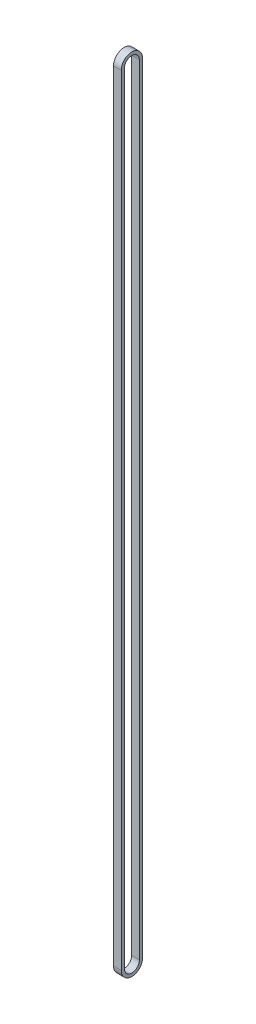
ISO-10303-21;
HEADER;
FILE_DESCRIPTION(('STEP AP214'),'2;1');
FILE_NAME('part.step','',(''),(''),'','','');
FILE_SCHEMA(('AUTOMOTIVE_DESIGN { 1 0 10303 214 1 1 1 1 }'));
ENDSEC;
DATA;
#1=APPLICATION_CONTEXT('core data for automotive mechanical design processes');
#2=APPLICATION_PROTOCOL_DEFINITION('international standard','automotive_design',2000,#1);
#3=PRODUCT_CONTEXT('',#1,'mechanical');
#4=PRODUCT('Part','Part','',(#3));
#5=PRODUCT_RELATED_PRODUCT_CATEGORY('part','',(#4));
#6=PRODUCT_DEFINITION_FORMATION('','',#4);
#7=PRODUCT_DEFINITION_CONTEXT('part definition',#1,'design');
#8=PRODUCT_DEFINITION('design','',#6,#7);
#9=PRODUCT_DEFINITION_SHAPE('','',#8);
#10=(LENGTH_UNIT() NAMED_UNIT(*) SI_UNIT(.MILLI.,.METRE.));
#11=(NAMED_UNIT(*) PLANE_ANGLE_UNIT() SI_UNIT($,.RADIAN.));
#12=(NAMED_UNIT(*) SI_UNIT($,.STERADIAN.) SOLID_ANGLE_UNIT());
#13=UNCERTAINTY_MEASURE_WITH_UNIT(LENGTH_MEASURE(1.E-05),#10,'distance_accuracy_value','');
#14=(GEOMETRIC_REPRESENTATION_CONTEXT(3) GLOBAL_UNCERTAINTY_ASSIGNED_CONTEXT((#13)) GLOBAL_UNIT_ASSIGNED_CONTEXT((#10,
#11,#12)) REPRESENTATION_CONTEXT('',''));
#15=CARTESIAN_POINT('',(0.,0.,0.));
#16=DIRECTION('',(0.,0.,1.));
#17=DIRECTION('',(1.,0.,0.));
#18=AXIS2_PLACEMENT_3D('',#15,#16,#17);
#19=CARTESIAN_POINT('',(193.5,534.,0.));
#20=DIRECTION('',(-1.,0.,0.));
#21=DIRECTION('',(0.,0.,1.));
#22=AXIS2_PLACEMENT_3D('',#19,#20,#21);
#23=PLANE('',#22);
#24=CARTESIAN_POINT('',(193.5,534.,0.));
#25=DIRECTION('',(-1.,0.,0.));
#26=DIRECTION('',(0.,0.,1.));
#27=AXIS2_PLACEMENT_3D('',#24,#25,#26);
#28=CIRCLE('',#27,6.85000000000002);
#29=CARTESIAN_POINT('',(193.5,534.,6.85000000000002));
#30=VERTEX_POINT('',#29);
#31=CARTESIAN_POINT('',(193.5,534.,-6.85000000000002));
#32=VERTEX_POINT('',#31);
#33=EDGE_CURVE('E133',#30,#32,#28,.T.);
#34=ORIENTED_EDGE('',*,*,#33,.T.);
#35=DIRECTION('',(0.,-1.,0.));
#36=VECTOR('',#35,1.);
#37=CARTESIAN_POINT('',(193.5,534.,-6.85000000000002));
#38=LINE('',#37,#36);
#39=CARTESIAN_POINT('',(193.5,31.,-6.85000000000004));
#40=VERTEX_POINT('',#39);
#41=EDGE_CURVE('E136',#32,#40,#38,.T.);
#42=ORIENTED_EDGE('',*,*,#41,.T.);
#43=CARTESIAN_POINT('',(193.5,31.,0.));
#44=DIRECTION('',(-1.,0.,0.));
#45=DIRECTION('',(0.,0.,1.));
#46=AXIS2_PLACEMENT_3D('',#43,#44,#45);
#47=CIRCLE('',#46,6.85000000000004);
#48=CARTESIAN_POINT('',(193.5,31.,6.85000000000008));
#49=VERTEX_POINT('',#48);
#50=EDGE_CURVE('E139',#40,#49,#47,.T.);
#51=ORIENTED_EDGE('',*,*,#50,.T.);
#52=DIRECTION('',(0.,1.,0.));
#53=VECTOR('',#52,1.);
#54=CARTESIAN_POINT('',(193.5,534.,6.85000000000002));
#55=LINE('',#54,#53);
#56=EDGE_CURVE('E141',#49,#30,#55,.T.);
#57=ORIENTED_EDGE('',*,*,#56,.T.);
#58=EDGE_LOOP('',(#34,#42,#51,#57));
#59=FACE_BOUND('',#58,.T.);
#60=DIRECTION('',(0.,1.,0.));
#61=VECTOR('',#60,1.);
#62=CARTESIAN_POINT('',(193.5,534.,4.85000000000002));
#63=LINE('',#62,#61);
#64=CARTESIAN_POINT('',(193.5,31.,4.85));
#65=VERTEX_POINT('',#64);
#66=CARTESIAN_POINT('',(193.5,534.,4.85000000000002));
#67=VERTEX_POINT('',#66);
#68=EDGE_CURVE('E105',#65,#67,#63,.T.);
#69=ORIENTED_EDGE('',*,*,#68,.F.);
#70=CARTESIAN_POINT('',(193.5,31.,0.));
#71=DIRECTION('',(-1.,0.,0.));
#72=DIRECTION('',(0.,0.,1.));
#73=AXIS2_PLACEMENT_3D('',#70,#71,#72);
#74=CIRCLE('',#73,4.85);
#75=CARTESIAN_POINT('',(193.5,31.,-4.85));
#76=VERTEX_POINT('',#75);
#77=EDGE_CURVE('E97',#76,#65,#74,.T.);
#78=ORIENTED_EDGE('',*,*,#77,.F.);
#79=DIRECTION('',(0.,-1.,0.));
#80=VECTOR('',#79,1.);
#81=CARTESIAN_POINT('',(193.5,31.,-4.85));
#82=LINE('',#81,#80);
#83=CARTESIAN_POINT('',(193.5,534.,-4.85000000000002));
#84=VERTEX_POINT('',#83);
#85=EDGE_CURVE('E119',#84,#76,#82,.T.);
#86=ORIENTED_EDGE('',*,*,#85,.F.);
#87=CARTESIAN_POINT('',(193.5,534.,0.));
#88=DIRECTION('',(-1.,0.,0.));
#89=DIRECTION('',(0.,0.,1.));
#90=AXIS2_PLACEMENT_3D('',#87,#88,#89);
#91=CIRCLE('',#90,4.85000000000002);
#92=EDGE_CURVE('E117',#67,#84,#91,.T.);
#93=ORIENTED_EDGE('',*,*,#92,.F.);
#94=EDGE_LOOP('',(#69,#78,#86,#93));
#95=FACE_BOUND('',#94,.T.);
#96=ADVANCED_FACE('F32',(#59,#95),#23,.T.);
#97=CARTESIAN_POINT('',(198.5,534.,0.));
#98=DIRECTION('',(-1.,0.,0.));
#99=DIRECTION('',(0.,0.,1.));
#100=AXIS2_PLACEMENT_3D('',#97,#98,#99);
#101=PLANE('',#100);
#102=CARTESIAN_POINT('',(198.5,534.,0.));
#103=DIRECTION('',(-1.,0.,0.));
#104=DIRECTION('',(0.,0.,1.));
#105=AXIS2_PLACEMENT_3D('',#102,#103,#104);
#106=CIRCLE('',#105,6.85000000000002);
#107=CARTESIAN_POINT('',(198.5,534.,6.85000000000002));
#108=VERTEX_POINT('',#107);
#109=CARTESIAN_POINT('',(198.5,534.,-6.85000000000002));
#110=VERTEX_POINT('',#109);
#111=EDGE_CURVE('E113',#108,#110,#106,.T.);
#112=ORIENTED_EDGE('',*,*,#111,.F.);
#113=DIRECTION('',(0.,1.,0.));
#114=VECTOR('',#113,1.);
#115=CARTESIAN_POINT('',(198.5,534.,6.85000000000002));
#116=LINE('',#115,#114);
#117=CARTESIAN_POINT('',(198.5,31.,6.85000000000008));
#118=VERTEX_POINT('',#117);
#119=EDGE_CURVE('E137',#118,#108,#116,.T.);
#120=ORIENTED_EDGE('',*,*,#119,.F.);
#121=CARTESIAN_POINT('',(198.5,31.,0.));
#122=DIRECTION('',(-1.,0.,0.));
#123=DIRECTION('',(0.,0.,1.));
#124=AXIS2_PLACEMENT_3D('',#121,#122,#123);
#125=CIRCLE('',#124,6.85000000000004);
#126=CARTESIAN_POINT('',(198.5,31.,-6.85000000000004));
#127=VERTEX_POINT('',#126);
#128=EDGE_CURVE('E148',#127,#118,#125,.T.);
#129=ORIENTED_EDGE('',*,*,#128,.F.);
#130=DIRECTION('',(0.,-1.,0.));
#131=VECTOR('',#130,1.);
#132=CARTESIAN_POINT('',(198.5,534.,-6.85000000000002));
#133=LINE('',#132,#131);
#134=EDGE_CURVE('E146',#110,#127,#133,.T.);
#135=ORIENTED_EDGE('',*,*,#134,.F.);
#136=EDGE_LOOP('',(#112,#120,#129,#135));
#137=FACE_BOUND('',#136,.T.);
#138=CARTESIAN_POINT('',(198.5,31.,0.));
#139=DIRECTION('',(-1.,0.,0.));
#140=DIRECTION('',(0.,0.,1.));
#141=AXIS2_PLACEMENT_3D('',#138,#139,#140);
#142=CIRCLE('',#141,4.85);
#143=CARTESIAN_POINT('',(198.5,31.,-4.85));
#144=VERTEX_POINT('',#143);
#145=CARTESIAN_POINT('',(198.5,31.,4.85));
#146=VERTEX_POINT('',#145);
#147=EDGE_CURVE('E55',#144,#146,#142,.T.);
#148=ORIENTED_EDGE('',*,*,#147,.T.);
#149=DIRECTION('',(0.,1.,0.));
#150=VECTOR('',#149,1.);
#151=CARTESIAN_POINT('',(198.5,534.,4.85000000000002));
#152=LINE('',#151,#150);
#153=CARTESIAN_POINT('',(198.5,534.,4.85000000000002));
#154=VERTEX_POINT('',#153);
#155=EDGE_CURVE('E112',#146,#154,#152,.T.);
#156=ORIENTED_EDGE('',*,*,#155,.T.);
#157=CARTESIAN_POINT('',(198.5,534.,0.));
#158=DIRECTION('',(-1.,0.,0.));
#159=DIRECTION('',(0.,0.,1.));
#160=AXIS2_PLACEMENT_3D('',#157,#158,#159);
#161=CIRCLE('',#160,4.85000000000002);
#162=CARTESIAN_POINT('',(198.5,534.,-4.85000000000002));
#163=VERTEX_POINT('',#162);
#164=EDGE_CURVE('E125',#154,#163,#161,.T.);
#165=ORIENTED_EDGE('',*,*,#164,.T.);
#166=DIRECTION('',(0.,-1.,0.));
#167=VECTOR('',#166,1.);
#168=CARTESIAN_POINT('',(198.5,31.,-4.85));
#169=LINE('',#168,#167);
#170=EDGE_CURVE('E106',#163,#144,#169,.T.);
#171=ORIENTED_EDGE('',*,*,#170,.T.);
#172=EDGE_LOOP('',(#148,#156,#165,#171));
#173=FACE_BOUND('',#172,.T.);
#174=ADVANCED_FACE('F166',(#137,#173),#101,.F.);
#175=CARTESIAN_POINT('',(193.5,534.,0.));
#176=DIRECTION('',(1.,0.,0.));
#177=DIRECTION('',(0.,0.,-1.));
#178=AXIS2_PLACEMENT_3D('',#175,#176,#177);
#179=CYLINDRICAL_SURFACE('',#178,6.85000000000002);
#180=ORIENTED_EDGE('',*,*,#111,.T.);
#181=DIRECTION('',(1.,0.,0.));
#182=VECTOR('',#181,1.);
#183=CARTESIAN_POINT('',(193.5,534.,-6.85000000000002));
#184=LINE('',#183,#182);
#185=EDGE_CURVE('E11',#32,#110,#184,.T.);
#186=ORIENTED_EDGE('',*,*,#185,.F.);
#187=ORIENTED_EDGE('',*,*,#33,.F.);
#188=DIRECTION('',(1.,0.,0.));
#189=VECTOR('',#188,1.);
#190=CARTESIAN_POINT('',(193.5,534.,6.85000000000002));
#191=LINE('',#190,#189);
#192=EDGE_CURVE('E143',#30,#108,#191,.T.);
#193=ORIENTED_EDGE('',*,*,#192,.T.);
#194=EDGE_LOOP('',(#180,#186,#187,#193));
#195=FACE_BOUND('',#194,.T.);
#196=ADVANCED_FACE('F34',(#195),#179,.T.);
#197=CARTESIAN_POINT('',(193.5,534.,-6.85000000000002));
#198=DIRECTION('',(0.,0.,1.));
#199=DIRECTION('',(0.,-1.,0.));
#200=AXIS2_PLACEMENT_3D('',#197,#198,#199);
#201=PLANE('',#200);
#202=ORIENTED_EDGE('',*,*,#134,.T.);
#203=DIRECTION('',(1.,0.,0.));
#204=VECTOR('',#203,1.);
#205=CARTESIAN_POINT('',(193.5,31.,-6.85000000000004));
#206=LINE('',#205,#204);
#207=EDGE_CURVE('E40',#40,#127,#206,.T.);
#208=ORIENTED_EDGE('',*,*,#207,.F.);
#209=ORIENTED_EDGE('',*,*,#41,.F.);
#210=ORIENTED_EDGE('',*,*,#185,.T.);
#211=EDGE_LOOP('',(#202,#208,#209,#210));
#212=FACE_BOUND('',#211,.T.);
#213=ADVANCED_FACE('F176',(#212),#201,.F.);
#214=CARTESIAN_POINT('',(193.5,31.,0.));
#215=DIRECTION('',(1.,0.,0.));
#216=DIRECTION('',(0.,0.,-1.));
#217=AXIS2_PLACEMENT_3D('',#214,#215,#216);
#218=CYLINDRICAL_SURFACE('',#217,6.85000000000004);
#219=ORIENTED_EDGE('',*,*,#128,.T.);
#220=DIRECTION('',(1.,0.,0.));
#221=VECTOR('',#220,1.);
#222=CARTESIAN_POINT('',(193.5,31.,6.85000000000008));
#223=LINE('',#222,#221);
#224=EDGE_CURVE('E153',#49,#118,#223,.T.);
#225=ORIENTED_EDGE('',*,*,#224,.F.);
#226=ORIENTED_EDGE('',*,*,#50,.F.);
#227=ORIENTED_EDGE('',*,*,#207,.T.);
#228=EDGE_LOOP('',(#219,#225,#226,#227));
#229=FACE_BOUND('',#228,.T.);
#230=ADVANCED_FACE('F160',(#229),#218,.T.);
#231=CARTESIAN_POINT('',(193.5,534.,6.85000000000002));
#232=DIRECTION('',(0.,0.,-1.));
#233=DIRECTION('',(0.,1.,0.));
#234=AXIS2_PLACEMENT_3D('',#231,#232,#233);
#235=PLANE('',#234);
#236=ORIENTED_EDGE('',*,*,#119,.T.);
#237=ORIENTED_EDGE('',*,*,#192,.F.);
#238=ORIENTED_EDGE('',*,*,#56,.F.);
#239=ORIENTED_EDGE('',*,*,#224,.T.);
#240=EDGE_LOOP('',(#236,#237,#238,#239));
#241=FACE_BOUND('',#240,.T.);
#242=ADVANCED_FACE('F170',(#241),#235,.F.);
#243=CARTESIAN_POINT('',(193.5,31.,0.));
#244=DIRECTION('',(1.,0.,0.));
#245=DIRECTION('',(0.,0.,-1.));
#246=AXIS2_PLACEMENT_3D('',#243,#244,#245);
#247=CYLINDRICAL_SURFACE('',#246,4.85);
#248=ORIENTED_EDGE('',*,*,#147,.F.);
#249=DIRECTION('',(1.,0.,0.));
#250=VECTOR('',#249,1.);
#251=CARTESIAN_POINT('',(193.5,31.,-4.85));
#252=LINE('',#251,#250);
#253=EDGE_CURVE('E101',#76,#144,#252,.T.);
#254=ORIENTED_EDGE('',*,*,#253,.F.);
#255=ORIENTED_EDGE('',*,*,#77,.T.);
#256=DIRECTION('',(1.,0.,0.));
#257=VECTOR('',#256,1.);
#258=CARTESIAN_POINT('',(193.5,31.,4.85));
#259=LINE('',#258,#257);
#260=EDGE_CURVE('E100',#65,#146,#259,.T.);
#261=ORIENTED_EDGE('',*,*,#260,.T.);
#262=EDGE_LOOP('',(#248,#254,#255,#261));
#263=FACE_BOUND('',#262,.T.);
#264=ADVANCED_FACE('F99',(#263),#247,.F.);
#265=CARTESIAN_POINT('',(193.5,534.,4.85000000000002));
#266=DIRECTION('',(0.,0.,-1.));
#267=DIRECTION('',(0.,1.,0.));
#268=AXIS2_PLACEMENT_3D('',#265,#266,#267);
#269=PLANE('',#268);
#270=ORIENTED_EDGE('',*,*,#155,.F.);
#271=ORIENTED_EDGE('',*,*,#260,.F.);
#272=ORIENTED_EDGE('',*,*,#68,.T.);
#273=DIRECTION('',(1.,0.,0.));
#274=VECTOR('',#273,1.);
#275=CARTESIAN_POINT('',(193.5,534.,4.85000000000002));
#276=LINE('',#275,#274);
#277=EDGE_CURVE('E114',#67,#154,#276,.T.);
#278=ORIENTED_EDGE('',*,*,#277,.T.);
#279=EDGE_LOOP('',(#270,#271,#272,#278));
#280=FACE_BOUND('',#279,.T.);
#281=ADVANCED_FACE('F109',(#280),#269,.T.);
#282=CARTESIAN_POINT('',(193.5,534.,0.));
#283=DIRECTION('',(1.,0.,0.));
#284=DIRECTION('',(0.,0.,-1.));
#285=AXIS2_PLACEMENT_3D('',#282,#283,#284);
#286=CYLINDRICAL_SURFACE('',#285,4.85000000000002);
#287=ORIENTED_EDGE('',*,*,#164,.F.);
#288=ORIENTED_EDGE('',*,*,#277,.F.);
#289=ORIENTED_EDGE('',*,*,#92,.T.);
#290=DIRECTION('',(1.,0.,0.));
#291=VECTOR('',#290,1.);
#292=CARTESIAN_POINT('',(193.5,534.,-4.85000000000002));
#293=LINE('',#292,#291);
#294=EDGE_CURVE('E47',#84,#163,#293,.T.);
#295=ORIENTED_EDGE('',*,*,#294,.T.);
#296=EDGE_LOOP('',(#287,#288,#289,#295));
#297=FACE_BOUND('',#296,.T.);
#298=ADVANCED_FACE('F199',(#297),#286,.F.);
#299=CARTESIAN_POINT('',(193.5,31.,-4.85));
#300=DIRECTION('',(0.,0.,1.));
#301=DIRECTION('',(0.,-1.,0.));
#302=AXIS2_PLACEMENT_3D('',#299,#300,#301);
#303=PLANE('',#302);
#304=ORIENTED_EDGE('',*,*,#170,.F.);
#305=ORIENTED_EDGE('',*,*,#294,.F.);
#306=ORIENTED_EDGE('',*,*,#85,.T.);
#307=ORIENTED_EDGE('',*,*,#253,.T.);
#308=EDGE_LOOP('',(#304,#305,#306,#307));
#309=FACE_BOUND('',#308,.T.);
#310=ADVANCED_FACE('F203',(#309),#303,.T.);
#311=CLOSED_SHELL('',(#96,#174,#196,#213,#230,#242,#264,#281,#298,#310));
#312=MANIFOLD_SOLID_BREP('B2',#311);
#313=ADVANCED_BREP_SHAPE_REPRESENTATION('',(#18,#312),#14);
#314=SHAPE_DEFINITION_REPRESENTATION(#9,#313);
ENDSEC;
END-ISO-10303-21;
